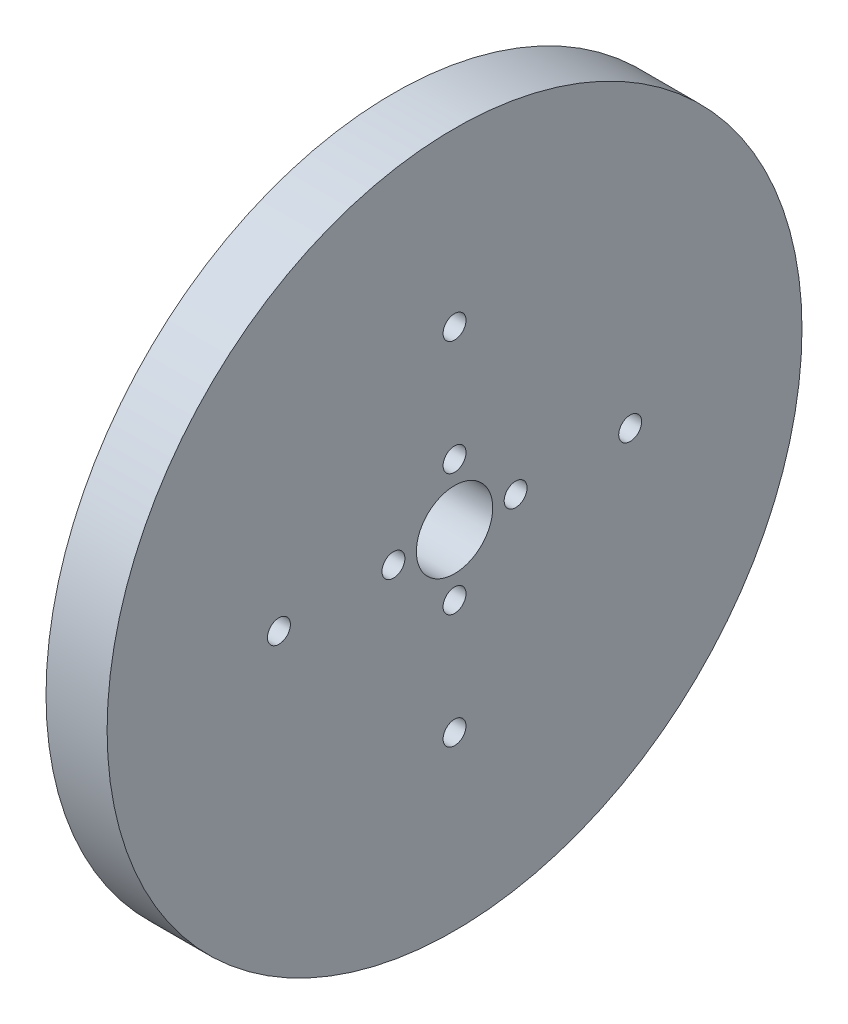
ISO-10303-21;
HEADER;
FILE_DESCRIPTION(('STEP AP214'),'2;1');
FILE_NAME('part.step','',(''),(''),'','','');
FILE_SCHEMA(('AUTOMOTIVE_DESIGN { 1 0 10303 214 1 1 1 1 }'));
ENDSEC;
DATA;
#1=APPLICATION_CONTEXT('core data for automotive mechanical design processes');
#2=APPLICATION_PROTOCOL_DEFINITION('international standard','automotive_design',2000,#1);
#3=PRODUCT_CONTEXT('',#1,'mechanical');
#4=PRODUCT('Part','Part','',(#3));
#5=PRODUCT_RELATED_PRODUCT_CATEGORY('part','',(#4));
#6=PRODUCT_DEFINITION_FORMATION('','',#4);
#7=PRODUCT_DEFINITION_CONTEXT('part definition',#1,'design');
#8=PRODUCT_DEFINITION('design','',#6,#7);
#9=PRODUCT_DEFINITION_SHAPE('','',#8);
#10=(LENGTH_UNIT() NAMED_UNIT(*) SI_UNIT(.MILLI.,.METRE.));
#11=(NAMED_UNIT(*) PLANE_ANGLE_UNIT() SI_UNIT($,.RADIAN.));
#12=(NAMED_UNIT(*) SI_UNIT($,.STERADIAN.) SOLID_ANGLE_UNIT());
#13=UNCERTAINTY_MEASURE_WITH_UNIT(LENGTH_MEASURE(1.E-05),#10,'distance_accuracy_value','');
#14=(GEOMETRIC_REPRESENTATION_CONTEXT(3) GLOBAL_UNCERTAINTY_ASSIGNED_CONTEXT((#13)) GLOBAL_UNIT_ASSIGNED_CONTEXT((#10,
#11,#12)) REPRESENTATION_CONTEXT('',''));
#15=CARTESIAN_POINT('',(0.,0.,0.));
#16=DIRECTION('',(0.,0.,1.));
#17=DIRECTION('',(1.,0.,0.));
#18=AXIS2_PLACEMENT_3D('',#15,#16,#17);
#19=CARTESIAN_POINT('',(8.,0.,0.));
#20=DIRECTION('',(-1.,0.,0.));
#21=DIRECTION('',(0.,0.,1.));
#22=AXIS2_PLACEMENT_3D('',#19,#20,#21);
#23=CYLINDRICAL_SURFACE('',#22,45.5);
#24=CARTESIAN_POINT('',(8.,0.,0.));
#25=DIRECTION('',(1.,0.,0.));
#26=DIRECTION('',(0.,0.,-1.));
#27=AXIS2_PLACEMENT_3D('',#24,#25,#26);
#28=CIRCLE('',#27,45.5);
#29=CARTESIAN_POINT('',(8.,0.,-45.5));
#30=VERTEX_POINT('',#29);
#31=EDGE_CURVE('E10',#30,#30,#28,.T.);
#32=ORIENTED_EDGE('',*,*,#31,.F.);
#33=EDGE_LOOP('',(#32));
#34=FACE_BOUND('',#33,.T.);
#35=CARTESIAN_POINT('',(0.,0.,0.));
#36=DIRECTION('',(1.,0.,0.));
#37=DIRECTION('',(0.,0.,-1.));
#38=AXIS2_PLACEMENT_3D('',#35,#36,#37);
#39=CIRCLE('',#38,45.5);
#40=CARTESIAN_POINT('',(0.,0.,-45.5));
#41=VERTEX_POINT('',#40);
#42=EDGE_CURVE('E36',#41,#41,#39,.T.);
#43=ORIENTED_EDGE('',*,*,#42,.T.);
#44=EDGE_LOOP('',(#43));
#45=FACE_BOUND('',#44,.T.);
#46=ADVANCED_FACE('F33',(#34,#45),#23,.T.);
#47=CARTESIAN_POINT('',(8.,0.,0.));
#48=DIRECTION('',(1.,0.,0.));
#49=DIRECTION('',(0.,0.,-1.));
#50=AXIS2_PLACEMENT_3D('',#47,#48,#49);
#51=PLANE('',#50);
#52=CARTESIAN_POINT('',(8.,-6.53699316899292E-13,22.9999999999993));
#53=DIRECTION('',(1.,0.,0.));
#54=DIRECTION('',(0.,0.,-1.));
#55=AXIS2_PLACEMENT_3D('',#52,#53,#54);
#56=CIRCLE('',#55,1.50000000000105);
#57=CARTESIAN_POINT('',(8.,-6.53699316899292E-13,21.4999999999983));
#58=VERTEX_POINT('',#57);
#59=EDGE_CURVE('E90',#58,#58,#56,.T.);
#60=ORIENTED_EDGE('',*,*,#59,.F.);
#61=EDGE_LOOP('',(#60));
#62=FACE_BOUND('',#61,.T.);
#63=CARTESIAN_POINT('',(8.,0.,8.));
#64=DIRECTION('',(1.,0.,0.));
#65=DIRECTION('',(0.,0.,-1.));
#66=AXIS2_PLACEMENT_3D('',#63,#64,#65);
#67=CIRCLE('',#66,1.5);
#68=CARTESIAN_POINT('',(8.,0.,6.5));
#69=VERTEX_POINT('',#68);
#70=EDGE_CURVE('E84',#69,#69,#67,.T.);
#71=ORIENTED_EDGE('',*,*,#70,.F.);
#72=EDGE_LOOP('',(#71));
#73=FACE_BOUND('',#72,.T.);
#74=CARTESIAN_POINT('',(8.,-23.0000000000001,0.));
#75=DIRECTION('',(1.,0.,0.));
#76=DIRECTION('',(0.,0.,-1.));
#77=AXIS2_PLACEMENT_3D('',#74,#75,#76);
#78=CIRCLE('',#77,1.50000000000005);
#79=CARTESIAN_POINT('',(8.,-23.0000000000001,-1.49999999999996));
#80=VERTEX_POINT('',#79);
#81=EDGE_CURVE('E78',#80,#80,#78,.T.);
#82=ORIENTED_EDGE('',*,*,#81,.F.);
#83=EDGE_LOOP('',(#82));
#84=FACE_BOUND('',#83,.T.);
#85=CARTESIAN_POINT('',(8.,-8.,0.));
#86=DIRECTION('',(1.,0.,0.));
#87=DIRECTION('',(0.,0.,-1.));
#88=AXIS2_PLACEMENT_3D('',#85,#86,#87);
#89=CIRCLE('',#88,1.5);
#90=CARTESIAN_POINT('',(8.,-8.,-1.49999999999994));
#91=VERTEX_POINT('',#90);
#92=EDGE_CURVE('E72',#91,#91,#89,.T.);
#93=ORIENTED_EDGE('',*,*,#92,.F.);
#94=EDGE_LOOP('',(#93));
#95=FACE_BOUND('',#94,.T.);
#96=CARTESIAN_POINT('',(8.,0.,-23.));
#97=DIRECTION('',(1.,0.,0.));
#98=DIRECTION('',(0.,0.,-1.));
#99=AXIS2_PLACEMENT_3D('',#96,#97,#98);
#100=CIRCLE('',#99,1.5);
#101=CARTESIAN_POINT('',(8.,0.,-24.5));
#102=VERTEX_POINT('',#101);
#103=EDGE_CURVE('E66',#102,#102,#100,.T.);
#104=ORIENTED_EDGE('',*,*,#103,.F.);
#105=EDGE_LOOP('',(#104));
#106=FACE_BOUND('',#105,.T.);
#107=CARTESIAN_POINT('',(8.,0.,-8.));
#108=DIRECTION('',(1.,0.,0.));
#109=DIRECTION('',(0.,0.,-1.));
#110=AXIS2_PLACEMENT_3D('',#107,#108,#109);
#111=CIRCLE('',#110,1.5);
#112=CARTESIAN_POINT('',(8.,0.,-9.5));
#113=VERTEX_POINT('',#112);
#114=EDGE_CURVE('E60',#113,#113,#111,.T.);
#115=ORIENTED_EDGE('',*,*,#114,.F.);
#116=EDGE_LOOP('',(#115));
#117=FACE_BOUND('',#116,.T.);
#118=CARTESIAN_POINT('',(8.,8.,0.));
#119=DIRECTION('',(1.,0.,0.));
#120=DIRECTION('',(0.,0.,-1.));
#121=AXIS2_PLACEMENT_3D('',#118,#119,#120);
#122=CIRCLE('',#121,1.5);
#123=CARTESIAN_POINT('',(8.,8.,-1.5));
#124=VERTEX_POINT('',#123);
#125=EDGE_CURVE('E54',#124,#124,#122,.T.);
#126=ORIENTED_EDGE('',*,*,#125,.F.);
#127=EDGE_LOOP('',(#126));
#128=FACE_BOUND('',#127,.T.);
#129=CARTESIAN_POINT('',(8.,23.,0.));
#130=DIRECTION('',(1.,0.,0.));
#131=DIRECTION('',(0.,0.,-1.));
#132=AXIS2_PLACEMENT_3D('',#129,#130,#131);
#133=CIRCLE('',#132,1.5);
#134=CARTESIAN_POINT('',(8.,23.,-1.5));
#135=VERTEX_POINT('',#134);
#136=EDGE_CURVE('E48',#135,#135,#133,.T.);
#137=ORIENTED_EDGE('',*,*,#136,.F.);
#138=EDGE_LOOP('',(#137));
#139=FACE_BOUND('',#138,.T.);
#140=CARTESIAN_POINT('',(8.,0.,0.));
#141=DIRECTION('',(1.,0.,0.));
#142=DIRECTION('',(0.,0.,-1.));
#143=AXIS2_PLACEMENT_3D('',#140,#141,#142);
#144=CIRCLE('',#143,5.);
#145=CARTESIAN_POINT('',(8.,0.,-5.));
#146=VERTEX_POINT('',#145);
#147=EDGE_CURVE('E43',#146,#146,#144,.T.);
#148=ORIENTED_EDGE('',*,*,#147,.F.);
#149=EDGE_LOOP('',(#148));
#150=FACE_BOUND('',#149,.T.);
#151=ORIENTED_EDGE('',*,*,#31,.T.);
#152=EDGE_LOOP('',(#151));
#153=FACE_BOUND('',#152,.T.);
#154=ADVANCED_FACE('F102',(#62,#73,#84,#95,#106,#117,#128,#139,#150,#153),#51,.T.);
#155=CARTESIAN_POINT('',(0.,0.,0.));
#156=DIRECTION('',(1.,0.,0.));
#157=DIRECTION('',(0.,0.,-1.));
#158=AXIS2_PLACEMENT_3D('',#155,#156,#157);
#159=PLANE('',#158);
#160=CARTESIAN_POINT('',(0.,-6.53699316899292E-13,22.9999999999993));
#161=DIRECTION('',(1.,0.,0.));
#162=DIRECTION('',(0.,0.,-1.));
#163=AXIS2_PLACEMENT_3D('',#160,#161,#162);
#164=CIRCLE('',#163,1.50000000000105);
#165=CARTESIAN_POINT('',(0.,-6.53699316899292E-13,21.4999999999983));
#166=VERTEX_POINT('',#165);
#167=EDGE_CURVE('E93',#166,#166,#164,.T.);
#168=ORIENTED_EDGE('',*,*,#167,.T.);
#169=EDGE_LOOP('',(#168));
#170=FACE_BOUND('',#169,.T.);
#171=CARTESIAN_POINT('',(0.,0.,8.));
#172=DIRECTION('',(1.,0.,0.));
#173=DIRECTION('',(0.,0.,-1.));
#174=AXIS2_PLACEMENT_3D('',#171,#172,#173);
#175=CIRCLE('',#174,1.5);
#176=CARTESIAN_POINT('',(0.,0.,6.5));
#177=VERTEX_POINT('',#176);
#178=EDGE_CURVE('E87',#177,#177,#175,.T.);
#179=ORIENTED_EDGE('',*,*,#178,.T.);
#180=EDGE_LOOP('',(#179));
#181=FACE_BOUND('',#180,.T.);
#182=CARTESIAN_POINT('',(0.,-23.0000000000001,0.));
#183=DIRECTION('',(1.,0.,0.));
#184=DIRECTION('',(0.,0.,-1.));
#185=AXIS2_PLACEMENT_3D('',#182,#183,#184);
#186=CIRCLE('',#185,1.50000000000005);
#187=CARTESIAN_POINT('',(0.,-23.0000000000001,-1.49999999999996));
#188=VERTEX_POINT('',#187);
#189=EDGE_CURVE('E81',#188,#188,#186,.T.);
#190=ORIENTED_EDGE('',*,*,#189,.T.);
#191=EDGE_LOOP('',(#190));
#192=FACE_BOUND('',#191,.T.);
#193=CARTESIAN_POINT('',(0.,-8.,0.));
#194=DIRECTION('',(1.,0.,0.));
#195=DIRECTION('',(0.,0.,-1.));
#196=AXIS2_PLACEMENT_3D('',#193,#194,#195);
#197=CIRCLE('',#196,1.5);
#198=CARTESIAN_POINT('',(0.,-8.,-1.49999999999994));
#199=VERTEX_POINT('',#198);
#200=EDGE_CURVE('E75',#199,#199,#197,.T.);
#201=ORIENTED_EDGE('',*,*,#200,.T.);
#202=EDGE_LOOP('',(#201));
#203=FACE_BOUND('',#202,.T.);
#204=CARTESIAN_POINT('',(0.,0.,-23.));
#205=DIRECTION('',(1.,0.,0.));
#206=DIRECTION('',(0.,0.,-1.));
#207=AXIS2_PLACEMENT_3D('',#204,#205,#206);
#208=CIRCLE('',#207,1.5);
#209=CARTESIAN_POINT('',(0.,0.,-24.5));
#210=VERTEX_POINT('',#209);
#211=EDGE_CURVE('E69',#210,#210,#208,.T.);
#212=ORIENTED_EDGE('',*,*,#211,.T.);
#213=EDGE_LOOP('',(#212));
#214=FACE_BOUND('',#213,.T.);
#215=CARTESIAN_POINT('',(0.,0.,-8.));
#216=DIRECTION('',(1.,0.,0.));
#217=DIRECTION('',(0.,0.,-1.));
#218=AXIS2_PLACEMENT_3D('',#215,#216,#217);
#219=CIRCLE('',#218,1.5);
#220=CARTESIAN_POINT('',(0.,0.,-9.5));
#221=VERTEX_POINT('',#220);
#222=EDGE_CURVE('E63',#221,#221,#219,.T.);
#223=ORIENTED_EDGE('',*,*,#222,.T.);
#224=EDGE_LOOP('',(#223));
#225=FACE_BOUND('',#224,.T.);
#226=CARTESIAN_POINT('',(0.,8.,0.));
#227=DIRECTION('',(1.,0.,0.));
#228=DIRECTION('',(0.,0.,-1.));
#229=AXIS2_PLACEMENT_3D('',#226,#227,#228);
#230=CIRCLE('',#229,1.5);
#231=CARTESIAN_POINT('',(0.,8.,-1.5));
#232=VERTEX_POINT('',#231);
#233=EDGE_CURVE('E57',#232,#232,#230,.T.);
#234=ORIENTED_EDGE('',*,*,#233,.T.);
#235=EDGE_LOOP('',(#234));
#236=FACE_BOUND('',#235,.T.);
#237=CARTESIAN_POINT('',(0.,23.,0.));
#238=DIRECTION('',(1.,0.,0.));
#239=DIRECTION('',(0.,0.,-1.));
#240=AXIS2_PLACEMENT_3D('',#237,#238,#239);
#241=CIRCLE('',#240,1.5);
#242=CARTESIAN_POINT('',(0.,23.,-1.5));
#243=VERTEX_POINT('',#242);
#244=EDGE_CURVE('E51',#243,#243,#241,.T.);
#245=ORIENTED_EDGE('',*,*,#244,.T.);
#246=EDGE_LOOP('',(#245));
#247=FACE_BOUND('',#246,.T.);
#248=CARTESIAN_POINT('',(0.,0.,0.));
#249=DIRECTION('',(1.,0.,0.));
#250=DIRECTION('',(0.,0.,-1.));
#251=AXIS2_PLACEMENT_3D('',#248,#249,#250);
#252=CIRCLE('',#251,5.);
#253=CARTESIAN_POINT('',(0.,0.,-5.));
#254=VERTEX_POINT('',#253);
#255=EDGE_CURVE('E45',#254,#254,#252,.T.);
#256=ORIENTED_EDGE('',*,*,#255,.T.);
#257=EDGE_LOOP('',(#256));
#258=FACE_BOUND('',#257,.T.);
#259=ORIENTED_EDGE('',*,*,#42,.F.);
#260=EDGE_LOOP('',(#259));
#261=FACE_BOUND('',#260,.T.);
#262=ADVANCED_FACE('F105',(#170,#181,#192,#203,#214,#225,#236,#247,#258,#261),#159,.F.);
#263=CARTESIAN_POINT('',(8.,0.,0.));
#264=DIRECTION('',(-1.,0.,0.));
#265=DIRECTION('',(0.,0.,1.));
#266=AXIS2_PLACEMENT_3D('',#263,#264,#265);
#267=CYLINDRICAL_SURFACE('',#266,5.);
#268=ORIENTED_EDGE('',*,*,#147,.T.);
#269=EDGE_LOOP('',(#268));
#270=FACE_BOUND('',#269,.T.);
#271=ORIENTED_EDGE('',*,*,#255,.F.);
#272=EDGE_LOOP('',(#271));
#273=FACE_BOUND('',#272,.T.);
#274=ADVANCED_FACE('F123',(#270,#273),#267,.F.);
#275=CARTESIAN_POINT('',(8.,23.,0.));
#276=DIRECTION('',(-1.,0.,0.));
#277=DIRECTION('',(0.,0.,1.));
#278=AXIS2_PLACEMENT_3D('',#275,#276,#277);
#279=CYLINDRICAL_SURFACE('',#278,1.5);
#280=ORIENTED_EDGE('',*,*,#136,.T.);
#281=EDGE_LOOP('',(#280));
#282=FACE_BOUND('',#281,.T.);
#283=ORIENTED_EDGE('',*,*,#244,.F.);
#284=EDGE_LOOP('',(#283));
#285=FACE_BOUND('',#284,.T.);
#286=ADVANCED_FACE('F126',(#282,#285),#279,.F.);
#287=CARTESIAN_POINT('',(8.,8.,0.));
#288=DIRECTION('',(-1.,0.,0.));
#289=DIRECTION('',(0.,0.,1.));
#290=AXIS2_PLACEMENT_3D('',#287,#288,#289);
#291=CYLINDRICAL_SURFACE('',#290,1.5);
#292=ORIENTED_EDGE('',*,*,#125,.T.);
#293=EDGE_LOOP('',(#292));
#294=FACE_BOUND('',#293,.T.);
#295=ORIENTED_EDGE('',*,*,#233,.F.);
#296=EDGE_LOOP('',(#295));
#297=FACE_BOUND('',#296,.T.);
#298=ADVANCED_FACE('F157',(#294,#297),#291,.F.);
#299=CARTESIAN_POINT('',(8.,0.,-8.));
#300=DIRECTION('',(-1.,0.,0.));
#301=DIRECTION('',(0.,0.,1.));
#302=AXIS2_PLACEMENT_3D('',#299,#300,#301);
#303=CYLINDRICAL_SURFACE('',#302,1.5);
#304=ORIENTED_EDGE('',*,*,#114,.T.);
#305=EDGE_LOOP('',(#304));
#306=FACE_BOUND('',#305,.T.);
#307=ORIENTED_EDGE('',*,*,#222,.F.);
#308=EDGE_LOOP('',(#307));
#309=FACE_BOUND('',#308,.T.);
#310=ADVANCED_FACE('F165',(#306,#309),#303,.F.);
#311=CARTESIAN_POINT('',(8.,0.,-23.));
#312=DIRECTION('',(-1.,0.,0.));
#313=DIRECTION('',(0.,0.,1.));
#314=AXIS2_PLACEMENT_3D('',#311,#312,#313);
#315=CYLINDRICAL_SURFACE('',#314,1.5);
#316=ORIENTED_EDGE('',*,*,#103,.T.);
#317=EDGE_LOOP('',(#316));
#318=FACE_BOUND('',#317,.T.);
#319=ORIENTED_EDGE('',*,*,#211,.F.);
#320=EDGE_LOOP('',(#319));
#321=FACE_BOUND('',#320,.T.);
#322=ADVANCED_FACE('F173',(#318,#321),#315,.F.);
#323=CARTESIAN_POINT('',(8.,-8.,0.));
#324=DIRECTION('',(-1.,0.,0.));
#325=DIRECTION('',(0.,0.,1.));
#326=AXIS2_PLACEMENT_3D('',#323,#324,#325);
#327=CYLINDRICAL_SURFACE('',#326,1.5);
#328=ORIENTED_EDGE('',*,*,#92,.T.);
#329=EDGE_LOOP('',(#328));
#330=FACE_BOUND('',#329,.T.);
#331=ORIENTED_EDGE('',*,*,#200,.F.);
#332=EDGE_LOOP('',(#331));
#333=FACE_BOUND('',#332,.T.);
#334=ADVANCED_FACE('F181',(#330,#333),#327,.F.);
#335=CARTESIAN_POINT('',(8.,-23.0000000000001,0.));
#336=DIRECTION('',(-1.,0.,0.));
#337=DIRECTION('',(0.,0.,1.));
#338=AXIS2_PLACEMENT_3D('',#335,#336,#337);
#339=CYLINDRICAL_SURFACE('',#338,1.50000000000005);
#340=ORIENTED_EDGE('',*,*,#81,.T.);
#341=EDGE_LOOP('',(#340));
#342=FACE_BOUND('',#341,.T.);
#343=ORIENTED_EDGE('',*,*,#189,.F.);
#344=EDGE_LOOP('',(#343));
#345=FACE_BOUND('',#344,.T.);
#346=ADVANCED_FACE('F189',(#342,#345),#339,.F.);
#347=CARTESIAN_POINT('',(8.,0.,8.));
#348=DIRECTION('',(-1.,0.,0.));
#349=DIRECTION('',(0.,0.,1.));
#350=AXIS2_PLACEMENT_3D('',#347,#348,#349);
#351=CYLINDRICAL_SURFACE('',#350,1.5);
#352=ORIENTED_EDGE('',*,*,#70,.T.);
#353=EDGE_LOOP('',(#352));
#354=FACE_BOUND('',#353,.T.);
#355=ORIENTED_EDGE('',*,*,#178,.F.);
#356=EDGE_LOOP('',(#355));
#357=FACE_BOUND('',#356,.T.);
#358=ADVANCED_FACE('F197',(#354,#357),#351,.F.);
#359=CARTESIAN_POINT('',(8.,-6.53699316899292E-13,22.9999999999993));
#360=DIRECTION('',(-1.,0.,0.));
#361=DIRECTION('',(0.,0.,1.));
#362=AXIS2_PLACEMENT_3D('',#359,#360,#361);
#363=CYLINDRICAL_SURFACE('',#362,1.50000000000105);
#364=ORIENTED_EDGE('',*,*,#59,.T.);
#365=EDGE_LOOP('',(#364));
#366=FACE_BOUND('',#365,.T.);
#367=ORIENTED_EDGE('',*,*,#167,.F.);
#368=EDGE_LOOP('',(#367));
#369=FACE_BOUND('',#368,.T.);
#370=ADVANCED_FACE('F99',(#366,#369),#363,.F.);
#371=CLOSED_SHELL('',(#46,#154,#262,#274,#286,#298,#310,#322,#334,#346,#358,#370));
#372=MANIFOLD_SOLID_BREP('B2',#371);
#373=ADVANCED_BREP_SHAPE_REPRESENTATION('',(#18,#372),#14);
#374=SHAPE_DEFINITION_REPRESENTATION(#9,#373);
ENDSEC;
END-ISO-10303-21;
